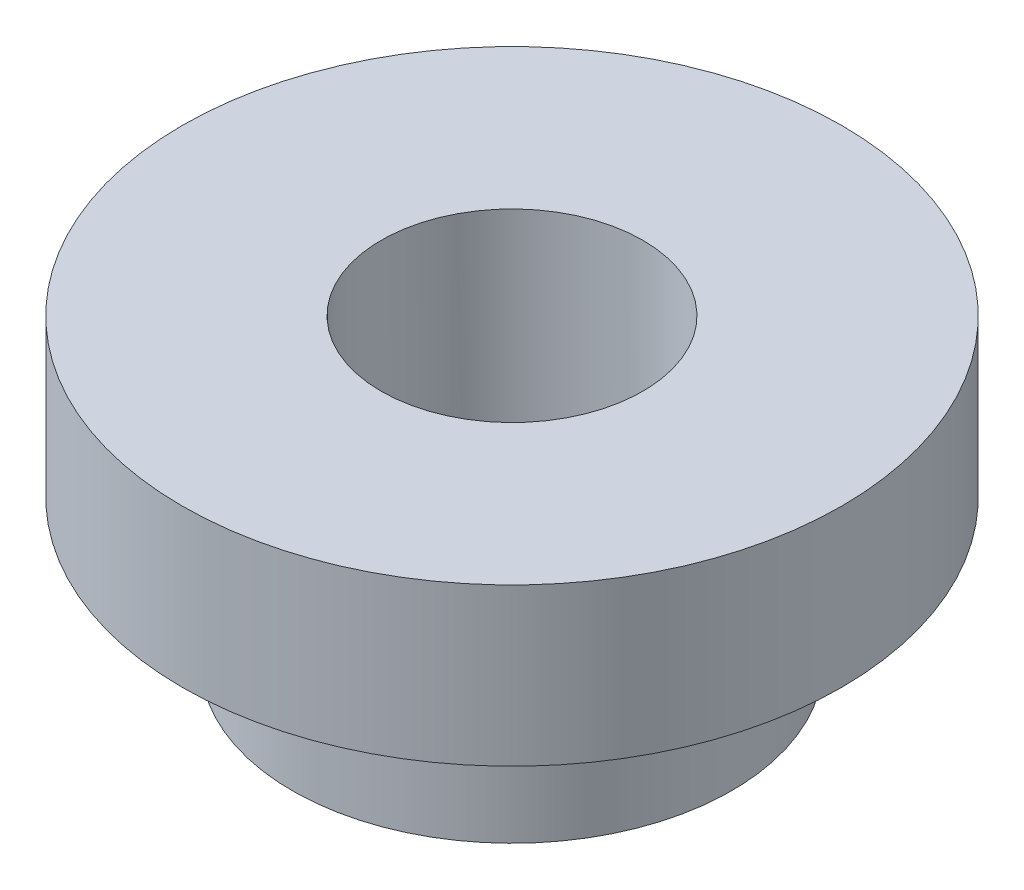
ISO-10303-21;
HEADER;
FILE_DESCRIPTION(('STEP AP214'),'2;1');
FILE_NAME('part.step','',(''),(''),'','','');
FILE_SCHEMA(('AUTOMOTIVE_DESIGN { 1 0 10303 214 1 1 1 1 }'));
ENDSEC;
DATA;
#1=APPLICATION_CONTEXT('core data for automotive mechanical design processes');
#2=APPLICATION_PROTOCOL_DEFINITION('international standard','automotive_design',2000,#1);
#3=PRODUCT_CONTEXT('',#1,'mechanical');
#4=PRODUCT('Part','Part','',(#3));
#5=PRODUCT_RELATED_PRODUCT_CATEGORY('part','',(#4));
#6=PRODUCT_DEFINITION_FORMATION('','',#4);
#7=PRODUCT_DEFINITION_CONTEXT('part definition',#1,'design');
#8=PRODUCT_DEFINITION('design','',#6,#7);
#9=PRODUCT_DEFINITION_SHAPE('','',#8);
#10=(LENGTH_UNIT() NAMED_UNIT(*) SI_UNIT(.MILLI.,.METRE.));
#11=(NAMED_UNIT(*) PLANE_ANGLE_UNIT() SI_UNIT($,.RADIAN.));
#12=(NAMED_UNIT(*) SI_UNIT($,.STERADIAN.) SOLID_ANGLE_UNIT());
#13=UNCERTAINTY_MEASURE_WITH_UNIT(LENGTH_MEASURE(1.E-05),#10,'distance_accuracy_value','');
#14=(GEOMETRIC_REPRESENTATION_CONTEXT(3) GLOBAL_UNCERTAINTY_ASSIGNED_CONTEXT((#13)) GLOBAL_UNIT_ASSIGNED_CONTEXT((#10,
#11,#12)) REPRESENTATION_CONTEXT('',''));
#15=CARTESIAN_POINT('',(0.,0.,0.));
#16=DIRECTION('',(0.,0.,1.));
#17=DIRECTION('',(1.,0.,0.));
#18=AXIS2_PLACEMENT_3D('',#15,#16,#17);
#19=CARTESIAN_POINT('',(0.,0.,0.));
#20=DIRECTION('',(0.,-1.,0.));
#21=DIRECTION('',(1.,0.,0.));
#22=AXIS2_PLACEMENT_3D('',#19,#20,#21);
#23=PLANE('',#22);
#24=CARTESIAN_POINT('',(0.,0.,0.));
#25=DIRECTION('',(0.,1.,0.));
#26=DIRECTION('',(0.,0.,1.));
#27=AXIS2_PLACEMENT_3D('',#24,#25,#26);
#28=CIRCLE('',#27,1.24999999999999);
#29=CARTESIAN_POINT('',(0.,0.,1.24999999999999));
#30=VERTEX_POINT('',#29);
#31=EDGE_CURVE('E58',#30,#30,#28,.T.);
#32=ORIENTED_EDGE('',*,*,#31,.F.);
#33=EDGE_LOOP('',(#32));
#34=FACE_BOUND('',#33,.T.);
#35=CARTESIAN_POINT('',(0.,0.,0.));
#36=DIRECTION('',(0.,1.,0.));
#37=DIRECTION('',(-1.,0.,0.));
#38=AXIS2_PLACEMENT_3D('',#35,#36,#37);
#39=CIRCLE('',#38,3.15);
#40=CARTESIAN_POINT('',(-3.15,0.,0.));
#41=VERTEX_POINT('',#40);
#42=EDGE_CURVE('E10',#41,#41,#39,.T.);
#43=ORIENTED_EDGE('',*,*,#42,.T.);
#44=EDGE_LOOP('',(#43));
#45=FACE_BOUND('',#44,.T.);
#46=ADVANCED_FACE('F36',(#34,#45),#23,.F.);
#47=CARTESIAN_POINT('',(0.,0.,0.));
#48=DIRECTION('',(0.,1.,0.));
#49=DIRECTION('',(-1.,0.,0.));
#50=AXIS2_PLACEMENT_3D('',#47,#48,#49);
#51=CYLINDRICAL_SURFACE('',#50,3.15);
#52=ORIENTED_EDGE('',*,*,#42,.F.);
#53=EDGE_LOOP('',(#52));
#54=FACE_BOUND('',#53,.T.);
#55=CARTESIAN_POINT('',(0.,-1.5,0.));
#56=DIRECTION('',(0.,1.,0.));
#57=DIRECTION('',(-1.,0.,0.));
#58=AXIS2_PLACEMENT_3D('',#55,#56,#57);
#59=CIRCLE('',#58,3.15);
#60=CARTESIAN_POINT('',(-3.15,-1.5,0.));
#61=VERTEX_POINT('',#60);
#62=EDGE_CURVE('E42',#61,#61,#59,.T.);
#63=ORIENTED_EDGE('',*,*,#62,.T.);
#64=EDGE_LOOP('',(#63));
#65=FACE_BOUND('',#64,.T.);
#66=ADVANCED_FACE('F66',(#54,#65),#51,.T.);
#67=CARTESIAN_POINT('',(3.15,-1.5,0.));
#68=DIRECTION('',(0.,1.,0.));
#69=DIRECTION('',(-1.,0.,0.));
#70=AXIS2_PLACEMENT_3D('',#67,#68,#69);
#71=PLANE('',#70);
#72=ORIENTED_EDGE('',*,*,#62,.F.);
#73=EDGE_LOOP('',(#72));
#74=FACE_BOUND('',#73,.T.);
#75=CARTESIAN_POINT('',(0.,-1.5,0.));
#76=DIRECTION('',(0.,1.,0.));
#77=DIRECTION('',(-1.,0.,0.));
#78=AXIS2_PLACEMENT_3D('',#75,#76,#77);
#79=CIRCLE('',#78,2.1);
#80=CARTESIAN_POINT('',(-2.1,-1.5,0.));
#81=VERTEX_POINT('',#80);
#82=EDGE_CURVE('E46',#81,#81,#79,.T.);
#83=ORIENTED_EDGE('',*,*,#82,.T.);
#84=EDGE_LOOP('',(#83));
#85=FACE_BOUND('',#84,.T.);
#86=ADVANCED_FACE('F70',(#74,#85),#71,.F.);
#87=CARTESIAN_POINT('',(0.,0.,0.));
#88=DIRECTION('',(0.,1.,0.));
#89=DIRECTION('',(-1.,0.,0.));
#90=AXIS2_PLACEMENT_3D('',#87,#88,#89);
#91=CYLINDRICAL_SURFACE('',#90,2.1);
#92=ORIENTED_EDGE('',*,*,#82,.F.);
#93=EDGE_LOOP('',(#92));
#94=FACE_BOUND('',#93,.T.);
#95=CARTESIAN_POINT('',(0.,-2.88,0.));
#96=DIRECTION('',(0.,1.,0.));
#97=DIRECTION('',(-1.,0.,0.));
#98=AXIS2_PLACEMENT_3D('',#95,#96,#97);
#99=CIRCLE('',#98,2.1);
#100=CARTESIAN_POINT('',(-2.1,-2.88,0.));
#101=VERTEX_POINT('',#100);
#102=EDGE_CURVE('E50',#101,#101,#99,.T.);
#103=ORIENTED_EDGE('',*,*,#102,.T.);
#104=EDGE_LOOP('',(#103));
#105=FACE_BOUND('',#104,.T.);
#106=ADVANCED_FACE('F75',(#94,#105),#91,.T.);
#107=CARTESIAN_POINT('',(2.1,-2.88,0.));
#108=DIRECTION('',(0.,1.,0.));
#109=DIRECTION('',(-1.,0.,0.));
#110=AXIS2_PLACEMENT_3D('',#107,#108,#109);
#111=PLANE('',#110);
#112=CARTESIAN_POINT('',(0.,-2.88,0.));
#113=DIRECTION('',(0.,1.,0.));
#114=DIRECTION('',(-1.,0.,0.));
#115=AXIS2_PLACEMENT_3D('',#112,#113,#114);
#116=CIRCLE('',#115,1.24999999999999);
#117=CARTESIAN_POINT('',(-1.24999999999999,-2.88,0.));
#118=VERTEX_POINT('',#117);
#119=EDGE_CURVE('E55',#118,#118,#116,.T.);
#120=ORIENTED_EDGE('',*,*,#119,.T.);
#121=EDGE_LOOP('',(#120));
#122=FACE_BOUND('',#121,.T.);
#123=ORIENTED_EDGE('',*,*,#102,.F.);
#124=EDGE_LOOP('',(#123));
#125=FACE_BOUND('',#124,.T.);
#126=ADVANCED_FACE('F81',(#122,#125),#111,.F.);
#127=CARTESIAN_POINT('',(0.,0.,0.));
#128=DIRECTION('',(0.,1.,0.));
#129=DIRECTION('',(0.,0.,1.));
#130=AXIS2_PLACEMENT_3D('',#127,#128,#129);
#131=CYLINDRICAL_SURFACE('',#130,1.24999999999999);
#132=ORIENTED_EDGE('',*,*,#31,.T.);
#133=EDGE_LOOP('',(#132));
#134=FACE_BOUND('',#133,.T.);
#135=ORIENTED_EDGE('',*,*,#119,.F.);
#136=EDGE_LOOP('',(#135));
#137=FACE_BOUND('',#136,.T.);
#138=ADVANCED_FACE('F62',(#134,#137),#131,.F.);
#139=CLOSED_SHELL('',(#46,#66,#86,#106,#126,#138));
#140=MANIFOLD_SOLID_BREP('B2',#139);
#141=ADVANCED_BREP_SHAPE_REPRESENTATION('',(#18,#140),#14);
#142=SHAPE_DEFINITION_REPRESENTATION(#9,#141);
ENDSEC;
END-ISO-10303-21;
